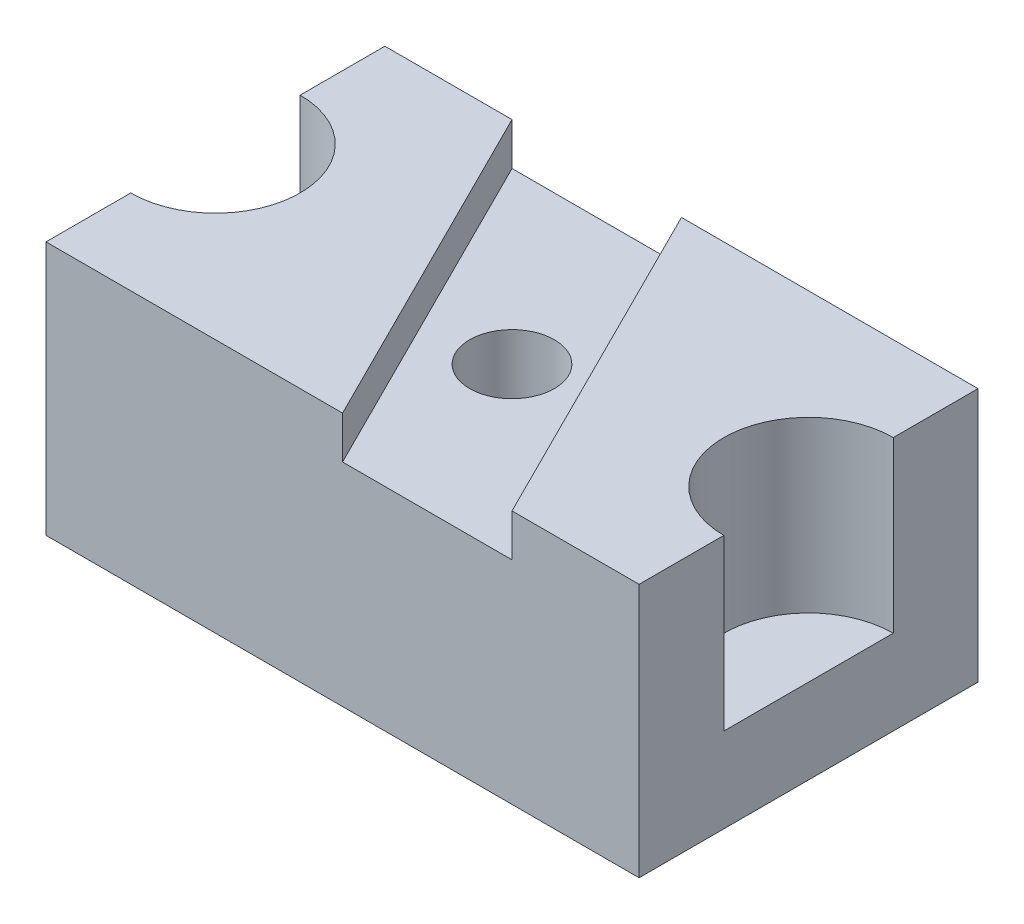
ISO-10303-21;
HEADER;
FILE_DESCRIPTION(('STEP AP214'),'2;1');
FILE_NAME('part.step','',(''),(''),'','','');
FILE_SCHEMA(('AUTOMOTIVE_DESIGN { 1 0 10303 214 1 1 1 1 }'));
ENDSEC;
DATA;
#1=APPLICATION_CONTEXT('core data for automotive mechanical design processes');
#2=APPLICATION_PROTOCOL_DEFINITION('international standard','automotive_design',2000,#1);
#3=PRODUCT_CONTEXT('',#1,'mechanical');
#4=PRODUCT('Part','Part','',(#3));
#5=PRODUCT_RELATED_PRODUCT_CATEGORY('part','',(#4));
#6=PRODUCT_DEFINITION_FORMATION('','',#4);
#7=PRODUCT_DEFINITION_CONTEXT('part definition',#1,'design');
#8=PRODUCT_DEFINITION('design','',#6,#7);
#9=PRODUCT_DEFINITION_SHAPE('','',#8);
#10=(LENGTH_UNIT() NAMED_UNIT(*) SI_UNIT(.MILLI.,.METRE.));
#11=(NAMED_UNIT(*) PLANE_ANGLE_UNIT() SI_UNIT($,.RADIAN.));
#12=(NAMED_UNIT(*) SI_UNIT($,.STERADIAN.) SOLID_ANGLE_UNIT());
#13=UNCERTAINTY_MEASURE_WITH_UNIT(LENGTH_MEASURE(1.E-05),#10,'distance_accuracy_value','');
#14=(GEOMETRIC_REPRESENTATION_CONTEXT(3) GLOBAL_UNCERTAINTY_ASSIGNED_CONTEXT((#13)) GLOBAL_UNIT_ASSIGNED_CONTEXT((#10,
#11,#12)) REPRESENTATION_CONTEXT('',''));
#15=CARTESIAN_POINT('',(0.,0.,0.));
#16=DIRECTION('',(0.,0.,1.));
#17=DIRECTION('',(1.,0.,0.));
#18=AXIS2_PLACEMENT_3D('',#15,#16,#17);
#19=CARTESIAN_POINT('',(3.5,1.,0.));
#20=DIRECTION('',(-1.,0.,0.));
#21=DIRECTION('',(0.,0.,1.));
#22=AXIS2_PLACEMENT_3D('',#19,#20,#21);
#23=PLANE('',#22);
#24=DIRECTION('',(0.,0.,-1.));
#25=VECTOR('',#24,1.);
#26=CARTESIAN_POINT('',(3.5,0.,0.));
#27=LINE('',#26,#25);
#28=CARTESIAN_POINT('',(3.5,0.,2.));
#29=VERTEX_POINT('',#28);
#30=CARTESIAN_POINT('',(3.5,0.,-2.));
#31=VERTEX_POINT('',#30);
#32=EDGE_CURVE('E42',#29,#31,#27,.T.);
#33=ORIENTED_EDGE('',*,*,#32,.T.);
#34=DIRECTION('',(0.,-1.,0.));
#35=VECTOR('',#34,1.);
#36=CARTESIAN_POINT('',(3.5,3.,-2.));
#37=LINE('',#36,#35);
#38=CARTESIAN_POINT('',(3.5,3.,-2.));
#39=VERTEX_POINT('',#38);
#40=EDGE_CURVE('E256',#39,#31,#37,.T.);
#41=ORIENTED_EDGE('',*,*,#40,.F.);
#42=DIRECTION('',(0.,0.,-1.));
#43=VECTOR('',#42,1.);
#44=CARTESIAN_POINT('',(3.5,3.,0.));
#45=LINE('',#44,#43);
#46=CARTESIAN_POINT('',(3.5,3.,-1.));
#47=VERTEX_POINT('',#46);
#48=EDGE_CURVE('E219',#47,#39,#45,.T.);
#49=ORIENTED_EDGE('',*,*,#48,.F.);
#50=DIRECTION('',(0.,-1.,0.));
#51=VECTOR('',#50,1.);
#52=CARTESIAN_POINT('',(3.5,3.,-1.));
#53=LINE('',#52,#51);
#54=CARTESIAN_POINT('',(3.5,1.,-1.));
#55=VERTEX_POINT('',#54);
#56=EDGE_CURVE('E260',#47,#55,#53,.T.);
#57=ORIENTED_EDGE('',*,*,#56,.T.);
#58=DIRECTION('',(0.,0.,-1.));
#59=VECTOR('',#58,1.);
#60=CARTESIAN_POINT('',(3.5,1.,0.));
#61=LINE('',#60,#59);
#62=CARTESIAN_POINT('',(3.5,1.,0.999999999999999));
#63=VERTEX_POINT('',#62);
#64=EDGE_CURVE('E48',#63,#55,#61,.T.);
#65=ORIENTED_EDGE('',*,*,#64,.F.);
#66=DIRECTION('',(0.,-1.,0.));
#67=VECTOR('',#66,1.);
#68=CARTESIAN_POINT('',(3.5,3.,0.999999999999999));
#69=LINE('',#68,#67);
#70=CARTESIAN_POINT('',(3.5,3.,0.999999999999999));
#71=VERTEX_POINT('',#70);
#72=EDGE_CURVE('E240',#71,#63,#69,.T.);
#73=ORIENTED_EDGE('',*,*,#72,.F.);
#74=CARTESIAN_POINT('',(3.5,3.,2.));
#75=VERTEX_POINT('',#74);
#76=EDGE_CURVE('E224',#75,#71,#45,.T.);
#77=ORIENTED_EDGE('',*,*,#76,.F.);
#78=DIRECTION('',(0.,-1.,0.));
#79=VECTOR('',#78,1.);
#80=CARTESIAN_POINT('',(3.5,3.,2.));
#81=LINE('',#80,#79);
#82=EDGE_CURVE('E244',#75,#29,#81,.T.);
#83=ORIENTED_EDGE('',*,*,#82,.T.);
#84=EDGE_LOOP('',(#33,#41,#49,#57,#65,#73,#77,#83));
#85=FACE_BOUND('',#84,.T.);
#86=ADVANCED_FACE('F39',(#85),#23,.F.);
#87=CARTESIAN_POINT('',(0.,1.,0.));
#88=DIRECTION('',(0.,1.,0.));
#89=DIRECTION('',(0.,0.,1.));
#90=AXIS2_PLACEMENT_3D('',#87,#88,#89);
#91=PLANE('',#90);
#92=ORIENTED_EDGE('',*,*,#64,.T.);
#93=CARTESIAN_POINT('',(3.5,1.,0.));
#94=DIRECTION('',(0.,1.,0.));
#95=DIRECTION('',(0.,0.,1.));
#96=AXIS2_PLACEMENT_3D('',#93,#94,#95);
#97=CIRCLE('',#96,1.);
#98=EDGE_CURVE('E11',#55,#63,#97,.T.);
#99=ORIENTED_EDGE('',*,*,#98,.T.);
#100=EDGE_LOOP('',(#92,#99));
#101=FACE_BOUND('',#100,.T.);
#102=ADVANCED_FACE('F312',(#101),#91,.T.);
#103=CARTESIAN_POINT('',(0.,0.,0.));
#104=DIRECTION('',(0.,1.,0.));
#105=DIRECTION('',(0.,0.,1.));
#106=AXIS2_PLACEMENT_3D('',#103,#104,#105);
#107=PLANE('',#106);
#108=ORIENTED_EDGE('',*,*,#32,.F.);
#109=DIRECTION('',(1.,0.,0.));
#110=VECTOR('',#109,1.);
#111=CARTESIAN_POINT('',(0.,0.,2.));
#112=LINE('',#111,#110);
#113=CARTESIAN_POINT('',(-3.5,0.,2.));
#114=VERTEX_POINT('',#113);
#115=EDGE_CURVE('E220',#114,#29,#112,.T.);
#116=ORIENTED_EDGE('',*,*,#115,.F.);
#117=DIRECTION('',(0.,0.,-1.));
#118=VECTOR('',#117,1.);
#119=CARTESIAN_POINT('',(-3.5,0.,0.));
#120=LINE('',#119,#118);
#121=CARTESIAN_POINT('',(-3.5,0.,-2.));
#122=VERTEX_POINT('',#121);
#123=EDGE_CURVE('E135',#114,#122,#120,.T.);
#124=ORIENTED_EDGE('',*,*,#123,.T.);
#125=DIRECTION('',(1.,0.,0.));
#126=VECTOR('',#125,1.);
#127=CARTESIAN_POINT('',(0.,0.,-2.));
#128=LINE('',#127,#126);
#129=EDGE_CURVE('E211',#122,#31,#128,.T.);
#130=ORIENTED_EDGE('',*,*,#129,.T.);
#131=EDGE_LOOP('',(#108,#116,#124,#130));
#132=FACE_BOUND('',#131,.T.);
#133=CARTESIAN_POINT('',(0.,0.,0.));
#134=DIRECTION('',(0.,1.,0.));
#135=DIRECTION('',(0.,0.,1.));
#136=AXIS2_PLACEMENT_3D('',#133,#134,#135);
#137=CIRCLE('',#136,0.5);
#138=CARTESIAN_POINT('',(0.,0.,0.499999999999999));
#139=VERTEX_POINT('',#138);
#140=EDGE_CURVE('E188',#139,#139,#137,.T.);
#141=ORIENTED_EDGE('',*,*,#140,.T.);
#142=EDGE_LOOP('',(#141));
#143=FACE_BOUND('',#142,.T.);
#144=ADVANCED_FACE('F274',(#132,#143),#107,.F.);
#145=CARTESIAN_POINT('',(3.5,3.,0.));
#146=DIRECTION('',(0.,-1.,0.));
#147=DIRECTION('',(0.,0.,-1.));
#148=AXIS2_PLACEMENT_3D('',#145,#146,#147);
#149=CYLINDRICAL_SURFACE('',#148,1.);
#150=ORIENTED_EDGE('',*,*,#72,.T.);
#151=ORIENTED_EDGE('',*,*,#98,.F.);
#152=ORIENTED_EDGE('',*,*,#56,.F.);
#153=CARTESIAN_POINT('',(3.5,3.,0.));
#154=DIRECTION('',(0.,1.,0.));
#155=DIRECTION('',(0.,0.,1.));
#156=AXIS2_PLACEMENT_3D('',#153,#154,#155);
#157=CIRCLE('',#156,1.);
#158=EDGE_CURVE('E215',#47,#71,#157,.T.);
#159=ORIENTED_EDGE('',*,*,#158,.T.);
#160=EDGE_LOOP('',(#150,#151,#152,#159));
#161=FACE_BOUND('',#160,.T.);
#162=ADVANCED_FACE('F293',(#161),#149,.F.);
#163=CARTESIAN_POINT('',(0.,3.,-2.));
#164=DIRECTION('',(0.,0.,-1.));
#165=DIRECTION('',(-1.,0.,0.));
#166=AXIS2_PLACEMENT_3D('',#163,#164,#165);
#167=PLANE('',#166);
#168=ORIENTED_EDGE('',*,*,#129,.F.);
#169=DIRECTION('',(0.,-1.,0.));
#170=VECTOR('',#169,1.);
#171=CARTESIAN_POINT('',(-3.5,3.,-2.));
#172=LINE('',#171,#170);
#173=CARTESIAN_POINT('',(-3.5,3.,-2.));
#174=VERTEX_POINT('',#173);
#175=EDGE_CURVE('E163',#174,#122,#172,.T.);
#176=ORIENTED_EDGE('',*,*,#175,.F.);
#177=DIRECTION('',(1.,0.,0.));
#178=VECTOR('',#177,1.);
#179=CARTESIAN_POINT('',(0.,3.,-2.));
#180=LINE('',#179,#178);
#181=CARTESIAN_POINT('',(-2.,3.,-2.));
#182=VERTEX_POINT('',#181);
#183=EDGE_CURVE('E159',#174,#182,#180,.T.);
#184=ORIENTED_EDGE('',*,*,#183,.T.);
#185=DIRECTION('',(0.,-1.,0.));
#186=VECTOR('',#185,1.);
#187=CARTESIAN_POINT('',(-2.,3.,-2.));
#188=LINE('',#187,#186);
#189=CARTESIAN_POINT('',(-2.,2.5,-2.));
#190=VERTEX_POINT('',#189);
#191=EDGE_CURVE('E174',#182,#190,#188,.T.);
#192=ORIENTED_EDGE('',*,*,#191,.T.);
#193=DIRECTION('',(1.,0.,0.));
#194=VECTOR('',#193,1.);
#195=CARTESIAN_POINT('',(0.,2.5,-2.));
#196=LINE('',#195,#194);
#197=CARTESIAN_POINT('',(0.,2.5,-2.));
#198=VERTEX_POINT('',#197);
#199=EDGE_CURVE('E200',#190,#198,#196,.T.);
#200=ORIENTED_EDGE('',*,*,#199,.T.);
#201=DIRECTION('',(0.,-1.,0.));
#202=VECTOR('',#201,1.);
#203=CARTESIAN_POINT('',(0.,3.,-2.));
#204=LINE('',#203,#202);
#205=CARTESIAN_POINT('',(0.,3.,-2.));
#206=VERTEX_POINT('',#205);
#207=EDGE_CURVE('E252',#206,#198,#204,.T.);
#208=ORIENTED_EDGE('',*,*,#207,.F.);
#209=DIRECTION('',(1.,0.,0.));
#210=VECTOR('',#209,1.);
#211=CARTESIAN_POINT('',(0.,3.,-2.));
#212=LINE('',#211,#210);
#213=EDGE_CURVE('E223',#206,#39,#212,.T.);
#214=ORIENTED_EDGE('',*,*,#213,.T.);
#215=ORIENTED_EDGE('',*,*,#40,.T.);
#216=EDGE_LOOP('',(#168,#176,#184,#192,#200,#208,#214,#215));
#217=FACE_BOUND('',#216,.T.);
#218=ADVANCED_FACE('F272',(#217),#167,.T.);
#219=CARTESIAN_POINT('',(0.8,3.,-0.4));
#220=DIRECTION('',(0.894427190999916,0.,-0.447213595499958));
#221=DIRECTION('',(-0.447213595499958,0.,-0.894427190999916));
#222=AXIS2_PLACEMENT_3D('',#219,#220,#221);
#223=PLANE('',#222);
#224=ORIENTED_EDGE('',*,*,#207,.T.);
#225=DIRECTION('',(0.447213595499958,0.,0.894427190999916));
#226=VECTOR('',#225,1.);
#227=CARTESIAN_POINT('',(0.8,2.5,-0.4));
#228=LINE('',#227,#226);
#229=CARTESIAN_POINT('',(2.,2.5,2.));
#230=VERTEX_POINT('',#229);
#231=EDGE_CURVE('E196',#198,#230,#228,.T.);
#232=ORIENTED_EDGE('',*,*,#231,.T.);
#233=DIRECTION('',(0.,-1.,0.));
#234=VECTOR('',#233,1.);
#235=CARTESIAN_POINT('',(2.,3.,2.));
#236=LINE('',#235,#234);
#237=CARTESIAN_POINT('',(2.,3.,2.));
#238=VERTEX_POINT('',#237);
#239=EDGE_CURVE('E248',#238,#230,#236,.T.);
#240=ORIENTED_EDGE('',*,*,#239,.F.);
#241=DIRECTION('',(0.447213595499958,0.,0.894427190999916));
#242=VECTOR('',#241,1.);
#243=CARTESIAN_POINT('',(0.8,3.,-0.4));
#244=LINE('',#243,#242);
#245=EDGE_CURVE('E228',#206,#238,#244,.T.);
#246=ORIENTED_EDGE('',*,*,#245,.F.);
#247=EDGE_LOOP('',(#224,#232,#240,#246));
#248=FACE_BOUND('',#247,.T.);
#249=ADVANCED_FACE('F285',(#248),#223,.F.);
#250=CARTESIAN_POINT('',(0.,3.,2.));
#251=DIRECTION('',(0.,0.,-1.));
#252=DIRECTION('',(-1.,0.,0.));
#253=AXIS2_PLACEMENT_3D('',#250,#251,#252);
#254=PLANE('',#253);
#255=ORIENTED_EDGE('',*,*,#115,.T.);
#256=ORIENTED_EDGE('',*,*,#82,.F.);
#257=DIRECTION('',(1.,0.,0.));
#258=VECTOR('',#257,1.);
#259=CARTESIAN_POINT('',(0.,3.,2.));
#260=LINE('',#259,#258);
#261=EDGE_CURVE('E231',#238,#75,#260,.T.);
#262=ORIENTED_EDGE('',*,*,#261,.F.);
#263=ORIENTED_EDGE('',*,*,#239,.T.);
#264=DIRECTION('',(1.,0.,0.));
#265=VECTOR('',#264,1.);
#266=CARTESIAN_POINT('',(0.,2.5,2.));
#267=LINE('',#266,#265);
#268=CARTESIAN_POINT('',(0.,2.5,2.));
#269=VERTEX_POINT('',#268);
#270=EDGE_CURVE('E208',#269,#230,#267,.T.);
#271=ORIENTED_EDGE('',*,*,#270,.F.);
#272=DIRECTION('',(0.,-1.,0.));
#273=VECTOR('',#272,1.);
#274=CARTESIAN_POINT('',(0.,3.,2.));
#275=LINE('',#274,#273);
#276=CARTESIAN_POINT('',(0.,3.,2.));
#277=VERTEX_POINT('',#276);
#278=EDGE_CURVE('E177',#277,#269,#275,.T.);
#279=ORIENTED_EDGE('',*,*,#278,.F.);
#280=DIRECTION('',(1.,0.,0.));
#281=VECTOR('',#280,1.);
#282=CARTESIAN_POINT('',(0.,3.,2.));
#283=LINE('',#282,#281);
#284=CARTESIAN_POINT('',(-3.5,3.,2.));
#285=VERTEX_POINT('',#284);
#286=EDGE_CURVE('E152',#285,#277,#283,.T.);
#287=ORIENTED_EDGE('',*,*,#286,.F.);
#288=DIRECTION('',(0.,-1.,0.));
#289=VECTOR('',#288,1.);
#290=CARTESIAN_POINT('',(-3.5,3.,2.));
#291=LINE('',#290,#289);
#292=EDGE_CURVE('E136',#285,#114,#291,.T.);
#293=ORIENTED_EDGE('',*,*,#292,.T.);
#294=EDGE_LOOP('',(#255,#256,#262,#263,#271,#279,#287,#293));
#295=FACE_BOUND('',#294,.T.);
#296=ADVANCED_FACE('F296',(#295),#254,.F.);
#297=CARTESIAN_POINT('',(0.,3.,0.));
#298=DIRECTION('',(0.,1.,0.));
#299=DIRECTION('',(0.,0.,1.));
#300=AXIS2_PLACEMENT_3D('',#297,#298,#299);
#301=PLANE('',#300);
#302=ORIENTED_EDGE('',*,*,#158,.F.);
#303=ORIENTED_EDGE('',*,*,#48,.T.);
#304=ORIENTED_EDGE('',*,*,#213,.F.);
#305=ORIENTED_EDGE('',*,*,#245,.T.);
#306=ORIENTED_EDGE('',*,*,#261,.T.);
#307=ORIENTED_EDGE('',*,*,#76,.T.);
#308=EDGE_LOOP('',(#302,#303,#304,#305,#306,#307));
#309=FACE_BOUND('',#308,.T.);
#310=ADVANCED_FACE('F290',(#309),#301,.T.);
#311=CARTESIAN_POINT('',(0.,2.5,0.));
#312=DIRECTION('',(0.,-1.,0.));
#313=DIRECTION('',(0.,0.,-1.));
#314=AXIS2_PLACEMENT_3D('',#311,#312,#313);
#315=CYLINDRICAL_SURFACE('',#314,0.5);
#316=CARTESIAN_POINT('',(0.,2.5,0.));
#317=DIRECTION('',(0.,1.,0.));
#318=DIRECTION('',(0.,0.,1.));
#319=AXIS2_PLACEMENT_3D('',#316,#317,#318);
#320=CIRCLE('',#319,0.5);
#321=CARTESIAN_POINT('',(0.,2.5,0.499999999999999));
#322=VERTEX_POINT('',#321);
#323=EDGE_CURVE('E192',#322,#322,#320,.T.);
#324=ORIENTED_EDGE('',*,*,#323,.T.);
#325=EDGE_LOOP('',(#324));
#326=FACE_BOUND('',#325,.T.);
#327=ORIENTED_EDGE('',*,*,#140,.F.);
#328=EDGE_LOOP('',(#327));
#329=FACE_BOUND('',#328,.T.);
#330=ADVANCED_FACE('F299',(#326,#329),#315,.F.);
#331=CARTESIAN_POINT('',(0.,2.5,0.));
#332=DIRECTION('',(0.,1.,0.));
#333=DIRECTION('',(0.,0.,1.));
#334=AXIS2_PLACEMENT_3D('',#331,#332,#333);
#335=PLANE('',#334);
#336=ORIENTED_EDGE('',*,*,#323,.F.);
#337=EDGE_LOOP('',(#336));
#338=FACE_BOUND('',#337,.T.);
#339=ORIENTED_EDGE('',*,*,#231,.F.);
#340=ORIENTED_EDGE('',*,*,#199,.F.);
#341=DIRECTION('',(-0.447213595499958,0.,-0.894427190999916));
#342=VECTOR('',#341,1.);
#343=CARTESIAN_POINT('',(-0.8,2.5,0.4));
#344=LINE('',#343,#342);
#345=EDGE_CURVE('E204',#269,#190,#344,.T.);
#346=ORIENTED_EDGE('',*,*,#345,.F.);
#347=ORIENTED_EDGE('',*,*,#270,.T.);
#348=EDGE_LOOP('',(#339,#340,#346,#347));
#349=FACE_BOUND('',#348,.T.);
#350=ADVANCED_FACE('F297',(#338,#349),#335,.T.);
#351=CARTESIAN_POINT('',(-3.5,1.,0.));
#352=DIRECTION('',(-1.,0.,0.));
#353=DIRECTION('',(0.,0.,1.));
#354=AXIS2_PLACEMENT_3D('',#351,#352,#353);
#355=PLANE('',#354);
#356=ORIENTED_EDGE('',*,*,#123,.F.);
#357=ORIENTED_EDGE('',*,*,#292,.F.);
#358=DIRECTION('',(0.,0.,-1.));
#359=VECTOR('',#358,1.);
#360=CARTESIAN_POINT('',(-3.5,3.,0.));
#361=LINE('',#360,#359);
#362=CARTESIAN_POINT('',(-3.5,3.,0.999999999999999));
#363=VERTEX_POINT('',#362);
#364=EDGE_CURVE('E141',#285,#363,#361,.T.);
#365=ORIENTED_EDGE('',*,*,#364,.T.);
#366=DIRECTION('',(0.,-1.,0.));
#367=VECTOR('',#366,1.);
#368=CARTESIAN_POINT('',(-3.5,3.,0.999999999999999));
#369=LINE('',#368,#367);
#370=CARTESIAN_POINT('',(-3.5,1.,0.999999999999999));
#371=VERTEX_POINT('',#370);
#372=EDGE_CURVE('E124',#363,#371,#369,.T.);
#373=ORIENTED_EDGE('',*,*,#372,.T.);
#374=DIRECTION('',(0.,0.,-1.));
#375=VECTOR('',#374,1.);
#376=CARTESIAN_POINT('',(-3.5,1.,0.));
#377=LINE('',#376,#375);
#378=CARTESIAN_POINT('',(-3.5,1.,-1.));
#379=VERTEX_POINT('',#378);
#380=EDGE_CURVE('E183',#371,#379,#377,.T.);
#381=ORIENTED_EDGE('',*,*,#380,.T.);
#382=DIRECTION('',(0.,-1.,0.));
#383=VECTOR('',#382,1.);
#384=CARTESIAN_POINT('',(-3.5,3.,-1.));
#385=LINE('',#384,#383);
#386=CARTESIAN_POINT('',(-3.5,3.,-1.));
#387=VERTEX_POINT('',#386);
#388=EDGE_CURVE('E158',#387,#379,#385,.T.);
#389=ORIENTED_EDGE('',*,*,#388,.F.);
#390=EDGE_CURVE('E144',#387,#174,#361,.T.);
#391=ORIENTED_EDGE('',*,*,#390,.T.);
#392=ORIENTED_EDGE('',*,*,#175,.T.);
#393=EDGE_LOOP('',(#356,#357,#365,#373,#381,#389,#391,#392));
#394=FACE_BOUND('',#393,.T.);
#395=ADVANCED_FACE('F148',(#394),#355,.T.);
#396=CARTESIAN_POINT('',(0.,1.,0.));
#397=DIRECTION('',(0.,1.,0.));
#398=DIRECTION('',(0.,0.,1.));
#399=AXIS2_PLACEMENT_3D('',#396,#397,#398);
#400=PLANE('',#399);
#401=ORIENTED_EDGE('',*,*,#380,.F.);
#402=CARTESIAN_POINT('',(-3.5,1.,0.));
#403=DIRECTION('',(0.,1.,0.));
#404=DIRECTION('',(0.,0.,1.));
#405=AXIS2_PLACEMENT_3D('',#402,#403,#404);
#406=CIRCLE('',#405,1.);
#407=EDGE_CURVE('E130',#371,#379,#406,.T.);
#408=ORIENTED_EDGE('',*,*,#407,.T.);
#409=EDGE_LOOP('',(#401,#408));
#410=FACE_BOUND('',#409,.T.);
#411=ADVANCED_FACE('F306',(#410),#400,.T.);
#412=CARTESIAN_POINT('',(-3.5,3.,0.));
#413=DIRECTION('',(0.,-1.,0.));
#414=DIRECTION('',(0.,0.,-1.));
#415=AXIS2_PLACEMENT_3D('',#412,#413,#414);
#416=CYLINDRICAL_SURFACE('',#415,1.);
#417=ORIENTED_EDGE('',*,*,#388,.T.);
#418=ORIENTED_EDGE('',*,*,#407,.F.);
#419=ORIENTED_EDGE('',*,*,#372,.F.);
#420=CARTESIAN_POINT('',(-3.5,3.,0.));
#421=DIRECTION('',(0.,1.,0.));
#422=DIRECTION('',(0.,0.,1.));
#423=AXIS2_PLACEMENT_3D('',#420,#421,#422);
#424=CIRCLE('',#423,1.);
#425=EDGE_CURVE('E128',#363,#387,#424,.T.);
#426=ORIENTED_EDGE('',*,*,#425,.T.);
#427=EDGE_LOOP('',(#417,#418,#419,#426));
#428=FACE_BOUND('',#427,.T.);
#429=ADVANCED_FACE('F127',(#428),#416,.F.);
#430=CARTESIAN_POINT('',(-0.8,3.,0.4));
#431=DIRECTION('',(-0.894427190999916,0.,0.447213595499958));
#432=DIRECTION('',(0.447213595499958,0.,0.894427190999916));
#433=AXIS2_PLACEMENT_3D('',#430,#431,#432);
#434=PLANE('',#433);
#435=ORIENTED_EDGE('',*,*,#345,.T.);
#436=ORIENTED_EDGE('',*,*,#191,.F.);
#437=DIRECTION('',(-0.447213595499958,0.,-0.894427190999916));
#438=VECTOR('',#437,1.);
#439=CARTESIAN_POINT('',(-0.8,3.,0.4));
#440=LINE('',#439,#438);
#441=EDGE_CURVE('E155',#277,#182,#440,.T.);
#442=ORIENTED_EDGE('',*,*,#441,.F.);
#443=ORIENTED_EDGE('',*,*,#278,.T.);
#444=EDGE_LOOP('',(#435,#436,#442,#443));
#445=FACE_BOUND('',#444,.T.);
#446=ADVANCED_FACE('F280',(#445),#434,.F.);
#447=CARTESIAN_POINT('',(0.,3.,0.));
#448=DIRECTION('',(0.,1.,0.));
#449=DIRECTION('',(0.,0.,1.));
#450=AXIS2_PLACEMENT_3D('',#447,#448,#449);
#451=PLANE('',#450);
#452=ORIENTED_EDGE('',*,*,#425,.F.);
#453=ORIENTED_EDGE('',*,*,#364,.F.);
#454=ORIENTED_EDGE('',*,*,#286,.T.);
#455=ORIENTED_EDGE('',*,*,#441,.T.);
#456=ORIENTED_EDGE('',*,*,#183,.F.);
#457=ORIENTED_EDGE('',*,*,#390,.F.);
#458=EDGE_LOOP('',(#452,#453,#454,#455,#456,#457));
#459=FACE_BOUND('',#458,.T.);
#460=ADVANCED_FACE('F140',(#459),#451,.T.);
#461=CLOSED_SHELL('',(#86,#102,#144,#162,#218,#249,#296,#310,#330,#350,#395,#411,#429,#446,#460));
#462=MANIFOLD_SOLID_BREP('B2',#461);
#463=ADVANCED_BREP_SHAPE_REPRESENTATION('',(#18,#462),#14);
#464=SHAPE_DEFINITION_REPRESENTATION(#9,#463);
ENDSEC;
END-ISO-10303-21;
